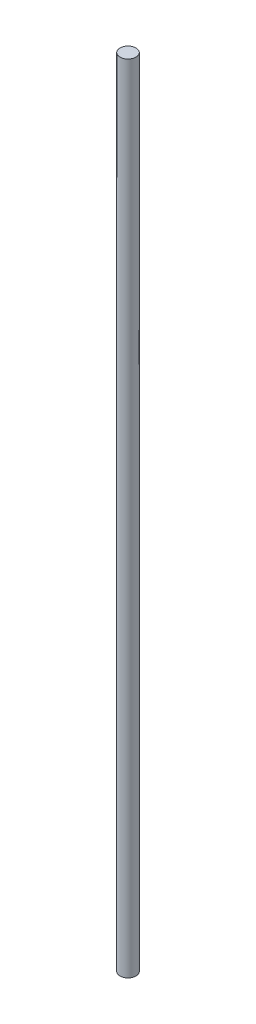
ISO-10303-21;
HEADER;
FILE_DESCRIPTION(('STEP AP214'),'2;1');
FILE_NAME('part.step','',(''),(''),'','','');
FILE_SCHEMA(('AUTOMOTIVE_DESIGN { 1 0 10303 214 1 1 1 1 }'));
ENDSEC;
DATA;
#1=APPLICATION_CONTEXT('core data for automotive mechanical design processes');
#2=APPLICATION_PROTOCOL_DEFINITION('international standard','automotive_design',2000,#1);
#3=PRODUCT_CONTEXT('',#1,'mechanical');
#4=PRODUCT('Part','Part','',(#3));
#5=PRODUCT_RELATED_PRODUCT_CATEGORY('part','',(#4));
#6=PRODUCT_DEFINITION_FORMATION('','',#4);
#7=PRODUCT_DEFINITION_CONTEXT('part definition',#1,'design');
#8=PRODUCT_DEFINITION('design','',#6,#7);
#9=PRODUCT_DEFINITION_SHAPE('','',#8);
#10=(LENGTH_UNIT() NAMED_UNIT(*) SI_UNIT(.MILLI.,.METRE.));
#11=(NAMED_UNIT(*) PLANE_ANGLE_UNIT() SI_UNIT($,.RADIAN.));
#12=(NAMED_UNIT(*) SI_UNIT($,.STERADIAN.) SOLID_ANGLE_UNIT());
#13=UNCERTAINTY_MEASURE_WITH_UNIT(LENGTH_MEASURE(1.E-05),#10,'distance_accuracy_value','');
#14=(GEOMETRIC_REPRESENTATION_CONTEXT(3) GLOBAL_UNCERTAINTY_ASSIGNED_CONTEXT((#13)) GLOBAL_UNIT_ASSIGNED_CONTEXT((#10,
#11,#12)) REPRESENTATION_CONTEXT('',''));
#15=CARTESIAN_POINT('',(0.,0.,0.));
#16=DIRECTION('',(0.,0.,1.));
#17=DIRECTION('',(1.,0.,0.));
#18=AXIS2_PLACEMENT_3D('',#15,#16,#17);
#19=CARTESIAN_POINT('',(0.,253.238,0.));
#20=DIRECTION('',(0.,-1.,0.));
#21=DIRECTION('',(0.,0.,-1.));
#22=AXIS2_PLACEMENT_3D('',#19,#20,#21);
#23=CYLINDRICAL_SURFACE('',#22,2.54);
#24=CARTESIAN_POINT('',(0.,253.238,0.));
#25=DIRECTION('',(0.,1.,0.));
#26=DIRECTION('',(0.,0.,1.));
#27=AXIS2_PLACEMENT_3D('',#24,#25,#26);
#28=CIRCLE('',#27,2.54);
#29=CARTESIAN_POINT('',(0.,253.238,2.54));
#30=VERTEX_POINT('',#29);
#31=EDGE_CURVE('E10',#30,#30,#28,.T.);
#32=ORIENTED_EDGE('',*,*,#31,.F.);
#33=EDGE_LOOP('',(#32));
#34=FACE_BOUND('',#33,.T.);
#35=CARTESIAN_POINT('',(0.,0.,0.));
#36=DIRECTION('',(0.,1.,0.));
#37=DIRECTION('',(0.,0.,1.));
#38=AXIS2_PLACEMENT_3D('',#35,#36,#37);
#39=CIRCLE('',#38,2.54);
#40=CARTESIAN_POINT('',(0.,0.,2.54));
#41=VERTEX_POINT('',#40);
#42=EDGE_CURVE('E40',#41,#41,#39,.T.);
#43=ORIENTED_EDGE('',*,*,#42,.T.);
#44=EDGE_LOOP('',(#43));
#45=FACE_BOUND('',#44,.T.);
#46=ADVANCED_FACE('F37',(#34,#45),#23,.T.);
#47=CARTESIAN_POINT('',(0.,253.238,0.));
#48=DIRECTION('',(0.,1.,0.));
#49=DIRECTION('',(0.,0.,1.));
#50=AXIS2_PLACEMENT_3D('',#47,#48,#49);
#51=PLANE('',#50);
#52=ORIENTED_EDGE('',*,*,#31,.T.);
#53=EDGE_LOOP('',(#52));
#54=FACE_BOUND('',#53,.T.);
#55=ADVANCED_FACE('F54',(#54),#51,.T.);
#56=CARTESIAN_POINT('',(0.,0.,0.));
#57=DIRECTION('',(0.,1.,0.));
#58=DIRECTION('',(0.,0.,1.));
#59=AXIS2_PLACEMENT_3D('',#56,#57,#58);
#60=PLANE('',#59);
#61=ORIENTED_EDGE('',*,*,#42,.F.);
#62=EDGE_LOOP('',(#61));
#63=FACE_BOUND('',#62,.T.);
#64=ADVANCED_FACE('F52',(#63),#60,.F.);
#65=CLOSED_SHELL('',(#46,#55,#64));
#66=MANIFOLD_SOLID_BREP('B2',#65);
#67=ADVANCED_BREP_SHAPE_REPRESENTATION('',(#18,#66),#14);
#68=SHAPE_DEFINITION_REPRESENTATION(#9,#67);
ENDSEC;
END-ISO-10303-21;
